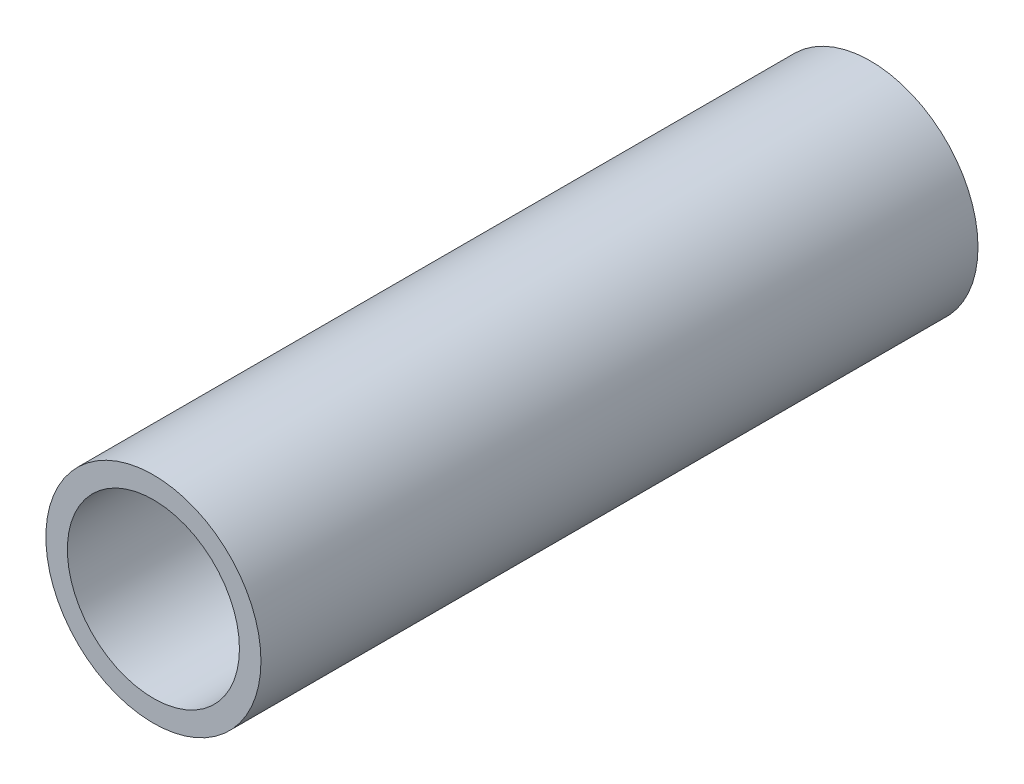
ISO-10303-21;
HEADER;
FILE_DESCRIPTION(('STEP AP214'),'2;1');
FILE_NAME('part.step','',(''),(''),'','','');
FILE_SCHEMA(('AUTOMOTIVE_DESIGN { 1 0 10303 214 1 1 1 1 }'));
ENDSEC;
DATA;
#1=APPLICATION_CONTEXT('core data for automotive mechanical design processes');
#2=APPLICATION_PROTOCOL_DEFINITION('international standard','automotive_design',2000,#1);
#3=PRODUCT_CONTEXT('',#1,'mechanical');
#4=PRODUCT('Part','Part','',(#3));
#5=PRODUCT_RELATED_PRODUCT_CATEGORY('part','',(#4));
#6=PRODUCT_DEFINITION_FORMATION('','',#4);
#7=PRODUCT_DEFINITION_CONTEXT('part definition',#1,'design');
#8=PRODUCT_DEFINITION('design','',#6,#7);
#9=PRODUCT_DEFINITION_SHAPE('','',#8);
#10=(LENGTH_UNIT() NAMED_UNIT(*) SI_UNIT(.MILLI.,.METRE.));
#11=(NAMED_UNIT(*) PLANE_ANGLE_UNIT() SI_UNIT($,.RADIAN.));
#12=(NAMED_UNIT(*) SI_UNIT($,.STERADIAN.) SOLID_ANGLE_UNIT());
#13=UNCERTAINTY_MEASURE_WITH_UNIT(LENGTH_MEASURE(1.E-05),#10,'distance_accuracy_value','');
#14=(GEOMETRIC_REPRESENTATION_CONTEXT(3) GLOBAL_UNCERTAINTY_ASSIGNED_CONTEXT((#13)) GLOBAL_UNIT_ASSIGNED_CONTEXT((#10,
#11,#12)) REPRESENTATION_CONTEXT('',''));
#15=CARTESIAN_POINT('',(0.,0.,0.));
#16=DIRECTION('',(0.,0.,1.));
#17=DIRECTION('',(1.,0.,0.));
#18=AXIS2_PLACEMENT_3D('',#15,#16,#17);
#19=CARTESIAN_POINT('',(0.,0.,50.));
#20=DIRECTION('',(0.,0.,1.));
#21=DIRECTION('',(1.,0.,0.));
#22=AXIS2_PLACEMENT_3D('',#19,#20,#21);
#23=PLANE('',#22);
#24=CARTESIAN_POINT('',(0.,0.,50.));
#25=DIRECTION('',(0.,0.,1.));
#26=DIRECTION('',(1.,0.,0.));
#27=AXIS2_PLACEMENT_3D('',#24,#25,#26);
#28=CIRCLE('',#27,7.5);
#29=CARTESIAN_POINT('',(7.5,0.,50.));
#30=VERTEX_POINT('',#29);
#31=EDGE_CURVE('E12',#30,#30,#28,.T.);
#32=ORIENTED_EDGE('',*,*,#31,.T.);
#33=EDGE_LOOP('',(#32));
#34=FACE_BOUND('',#33,.T.);
#35=CARTESIAN_POINT('',(0.,0.,50.));
#36=DIRECTION('',(0.,0.,1.));
#37=DIRECTION('',(1.,0.,0.));
#38=AXIS2_PLACEMENT_3D('',#35,#36,#37);
#39=CIRCLE('',#38,6.);
#40=CARTESIAN_POINT('',(6.,0.,50.));
#41=VERTEX_POINT('',#40);
#42=EDGE_CURVE('E58',#41,#41,#39,.T.);
#43=ORIENTED_EDGE('',*,*,#42,.F.);
#44=EDGE_LOOP('',(#43));
#45=FACE_BOUND('',#44,.T.);
#46=ADVANCED_FACE('F47',(#34,#45),#23,.T.);
#47=CARTESIAN_POINT('',(0.,0.,0.));
#48=DIRECTION('',(0.,0.,1.));
#49=DIRECTION('',(1.,0.,0.));
#50=AXIS2_PLACEMENT_3D('',#47,#48,#49);
#51=PLANE('',#50);
#52=CARTESIAN_POINT('',(0.,0.,0.));
#53=DIRECTION('',(0.,0.,1.));
#54=DIRECTION('',(1.,0.,0.));
#55=AXIS2_PLACEMENT_3D('',#52,#53,#54);
#56=CIRCLE('',#55,7.5);
#57=CARTESIAN_POINT('',(7.5,0.,0.));
#58=VERTEX_POINT('',#57);
#59=EDGE_CURVE('E51',#58,#58,#56,.T.);
#60=ORIENTED_EDGE('',*,*,#59,.F.);
#61=EDGE_LOOP('',(#60));
#62=FACE_BOUND('',#61,.T.);
#63=CARTESIAN_POINT('',(0.,0.,0.));
#64=DIRECTION('',(0.,0.,1.));
#65=DIRECTION('',(1.,0.,0.));
#66=AXIS2_PLACEMENT_3D('',#63,#64,#65);
#67=CIRCLE('',#66,6.);
#68=CARTESIAN_POINT('',(6.,0.,0.));
#69=VERTEX_POINT('',#68);
#70=EDGE_CURVE('E60',#69,#69,#67,.T.);
#71=ORIENTED_EDGE('',*,*,#70,.T.);
#72=EDGE_LOOP('',(#71));
#73=FACE_BOUND('',#72,.T.);
#74=ADVANCED_FACE('F70',(#62,#73),#51,.F.);
#75=CARTESIAN_POINT('',(0.,0.,50.));
#76=DIRECTION('',(0.,0.,-1.));
#77=DIRECTION('',(-1.,0.,0.));
#78=AXIS2_PLACEMENT_3D('',#75,#76,#77);
#79=CYLINDRICAL_SURFACE('',#78,7.5);
#80=ORIENTED_EDGE('',*,*,#31,.F.);
#81=EDGE_LOOP('',(#80));
#82=FACE_BOUND('',#81,.T.);
#83=ORIENTED_EDGE('',*,*,#59,.T.);
#84=EDGE_LOOP('',(#83));
#85=FACE_BOUND('',#84,.T.);
#86=ADVANCED_FACE('F49',(#82,#85),#79,.T.);
#87=CARTESIAN_POINT('',(0.,0.,50.));
#88=DIRECTION('',(0.,0.,-1.));
#89=DIRECTION('',(-1.,0.,0.));
#90=AXIS2_PLACEMENT_3D('',#87,#88,#89);
#91=CYLINDRICAL_SURFACE('',#90,6.);
#92=ORIENTED_EDGE('',*,*,#42,.T.);
#93=EDGE_LOOP('',(#92));
#94=FACE_BOUND('',#93,.T.);
#95=ORIENTED_EDGE('',*,*,#70,.F.);
#96=EDGE_LOOP('',(#95));
#97=FACE_BOUND('',#96,.T.);
#98=ADVANCED_FACE('F66',(#94,#97),#91,.F.);
#99=CLOSED_SHELL('',(#46,#74,#86,#98));
#100=MANIFOLD_SOLID_BREP('B2',#99);
#101=ADVANCED_BREP_SHAPE_REPRESENTATION('',(#18,#100),#14);
#102=SHAPE_DEFINITION_REPRESENTATION(#9,#101);
ENDSEC;
END-ISO-10303-21;
